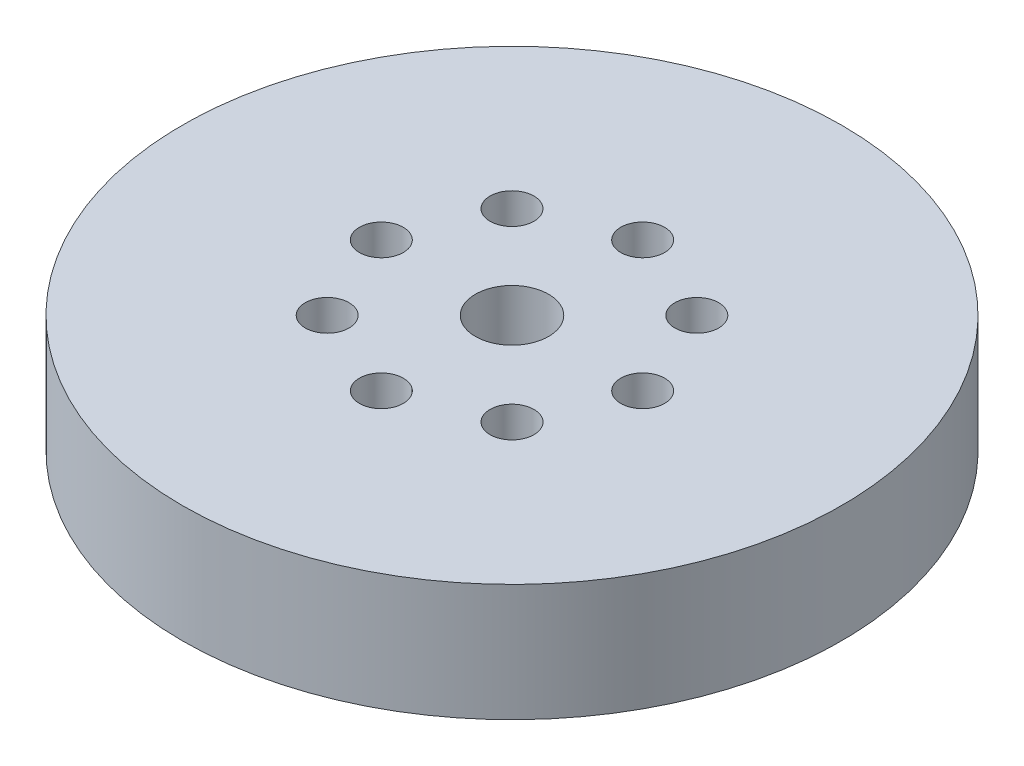
ISO-10303-21;
HEADER;
FILE_DESCRIPTION(('STEP AP214'),'2;1');
FILE_NAME('part.step','',(''),(''),'','','');
FILE_SCHEMA(('AUTOMOTIVE_DESIGN { 1 0 10303 214 1 1 1 1 }'));
ENDSEC;
DATA;
#1=APPLICATION_CONTEXT('core data for automotive mechanical design processes');
#2=APPLICATION_PROTOCOL_DEFINITION('international standard','automotive_design',2000,#1);
#3=PRODUCT_CONTEXT('',#1,'mechanical');
#4=PRODUCT('Part','Part','',(#3));
#5=PRODUCT_RELATED_PRODUCT_CATEGORY('part','',(#4));
#6=PRODUCT_DEFINITION_FORMATION('','',#4);
#7=PRODUCT_DEFINITION_CONTEXT('part definition',#1,'design');
#8=PRODUCT_DEFINITION('design','',#6,#7);
#9=PRODUCT_DEFINITION_SHAPE('','',#8);
#10=(LENGTH_UNIT() NAMED_UNIT(*) SI_UNIT(.MILLI.,.METRE.));
#11=(NAMED_UNIT(*) PLANE_ANGLE_UNIT() SI_UNIT($,.RADIAN.));
#12=(NAMED_UNIT(*) SI_UNIT($,.STERADIAN.) SOLID_ANGLE_UNIT());
#13=UNCERTAINTY_MEASURE_WITH_UNIT(LENGTH_MEASURE(1.E-05),#10,'distance_accuracy_value','');
#14=(GEOMETRIC_REPRESENTATION_CONTEXT(3) GLOBAL_UNCERTAINTY_ASSIGNED_CONTEXT((#13)) GLOBAL_UNIT_ASSIGNED_CONTEXT((#10,
#11,#12)) REPRESENTATION_CONTEXT('',''));
#15=CARTESIAN_POINT('',(0.,0.,0.));
#16=DIRECTION('',(0.,0.,1.));
#17=DIRECTION('',(1.,0.,0.));
#18=AXIS2_PLACEMENT_3D('',#15,#16,#17);
#19=CARTESIAN_POINT('',(0.,16.,0.));
#20=DIRECTION('',(0.,-1.,0.));
#21=DIRECTION('',(0.,0.,-1.));
#22=AXIS2_PLACEMENT_3D('',#19,#20,#21);
#23=CYLINDRICAL_SURFACE('',#22,45.);
#24=CARTESIAN_POINT('',(0.,16.,0.));
#25=DIRECTION('',(0.,1.,0.));
#26=DIRECTION('',(0.,0.,1.));
#27=AXIS2_PLACEMENT_3D('',#24,#25,#26);
#28=CIRCLE('',#27,45.);
#29=CARTESIAN_POINT('',(0.,16.,45.));
#30=VERTEX_POINT('',#29);
#31=EDGE_CURVE('E10',#30,#30,#28,.T.);
#32=ORIENTED_EDGE('',*,*,#31,.F.);
#33=EDGE_LOOP('',(#32));
#34=FACE_BOUND('',#33,.T.);
#35=CARTESIAN_POINT('',(0.,0.,0.));
#36=DIRECTION('',(0.,1.,0.));
#37=DIRECTION('',(0.,0.,1.));
#38=AXIS2_PLACEMENT_3D('',#35,#36,#37);
#39=CIRCLE('',#38,45.);
#40=CARTESIAN_POINT('',(0.,0.,45.));
#41=VERTEX_POINT('',#40);
#42=EDGE_CURVE('E37',#41,#41,#39,.T.);
#43=ORIENTED_EDGE('',*,*,#42,.T.);
#44=EDGE_LOOP('',(#43));
#45=FACE_BOUND('',#44,.T.);
#46=ADVANCED_FACE('F40',(#34,#45),#23,.T.);
#47=CARTESIAN_POINT('',(0.,16.,0.));
#48=DIRECTION('',(0.,1.,0.));
#49=DIRECTION('',(0.,0.,1.));
#50=AXIS2_PLACEMENT_3D('',#47,#48,#49);
#51=PLANE('',#50);
#52=CARTESIAN_POINT('',(0.,16.,17.8444050801665));
#53=DIRECTION('',(0.,1.,0.));
#54=DIRECTION('',(1.,0.,0.));
#55=AXIS2_PLACEMENT_3D('',#52,#53,#54);
#56=CIRCLE('',#55,2.99490753026362);
#57=CARTESIAN_POINT('',(2.99490753026368,16.,17.8444050801664));
#58=VERTEX_POINT('',#57);
#59=EDGE_CURVE('E88',#58,#58,#56,.T.);
#60=ORIENTED_EDGE('',*,*,#59,.F.);
#61=EDGE_LOOP('',(#60));
#62=FACE_BOUND('',#61,.T.);
#63=CARTESIAN_POINT('',(12.6178998384254,16.,12.6178998384253));
#64=DIRECTION('',(0.,1.,0.));
#65=DIRECTION('',(0.707106781186544,0.,-0.707106781186551));
#66=AXIS2_PLACEMENT_3D('',#63,#64,#65);
#67=CIRCLE('',#66,2.99490753026362);
#68=CARTESIAN_POINT('',(14.7356192621015,16.,10.5001804147492));
#69=VERTEX_POINT('',#68);
#70=EDGE_CURVE('E79',#69,#69,#67,.T.);
#71=ORIENTED_EDGE('',*,*,#70,.F.);
#72=EDGE_LOOP('',(#71));
#73=FACE_BOUND('',#72,.T.);
#74=CARTESIAN_POINT('',(17.8444050801665,16.,0.));
#75=DIRECTION('',(0.,1.,0.));
#76=DIRECTION('',(0.,0.,-1.));
#77=AXIS2_PLACEMENT_3D('',#74,#75,#76);
#78=CIRCLE('',#77,2.99490753026362);
#79=CARTESIAN_POINT('',(17.8444050801665,16.,-2.99490753026362));
#80=VERTEX_POINT('',#79);
#81=EDGE_CURVE('E74',#80,#80,#78,.T.);
#82=ORIENTED_EDGE('',*,*,#81,.F.);
#83=EDGE_LOOP('',(#82));
#84=FACE_BOUND('',#83,.T.);
#85=CARTESIAN_POINT('',(12.6178998384253,16.,-12.6178998384255));
#86=DIRECTION('',(0.,1.,0.));
#87=DIRECTION('',(-0.707106781186554,0.,-0.707106781186541));
#88=AXIS2_PLACEMENT_3D('',#85,#86,#87);
#89=CIRCLE('',#88,2.99490753026362);
#90=CARTESIAN_POINT('',(10.5001804147492,16.,-14.7356192621015));
#91=VERTEX_POINT('',#90);
#92=EDGE_CURVE('E70',#91,#91,#89,.T.);
#93=ORIENTED_EDGE('',*,*,#92,.F.);
#94=EDGE_LOOP('',(#93));
#95=FACE_BOUND('',#94,.T.);
#96=CARTESIAN_POINT('',(-1.86910222020476E-13,16.,-17.8444050801665));
#97=DIRECTION('',(0.,1.,0.));
#98=DIRECTION('',(-1.,0.,0.));
#99=AXIS2_PLACEMENT_3D('',#96,#97,#98);
#100=CIRCLE('',#99,2.99490753026362);
#101=CARTESIAN_POINT('',(-2.99490753026381,16.,-17.8444050801664));
#102=VERTEX_POINT('',#101);
#103=EDGE_CURVE('E100',#102,#102,#100,.T.);
#104=ORIENTED_EDGE('',*,*,#103,.F.);
#105=EDGE_LOOP('',(#104));
#106=FACE_BOUND('',#105,.T.);
#107=CARTESIAN_POINT('',(-12.6178998384255,16.,-12.6178998384252));
#108=DIRECTION('',(0.,1.,0.));
#109=DIRECTION('',(-0.707106781186539,0.,0.707106781186556));
#110=AXIS2_PLACEMENT_3D('',#107,#108,#109);
#111=CIRCLE('',#110,2.99490753026362);
#112=CARTESIAN_POINT('',(-14.7356192621016,16.,-10.5001804147491));
#113=VERTEX_POINT('',#112);
#114=EDGE_CURVE('E93',#113,#113,#111,.T.);
#115=ORIENTED_EDGE('',*,*,#114,.F.);
#116=EDGE_LOOP('',(#115));
#117=FACE_BOUND('',#116,.T.);
#118=CARTESIAN_POINT('',(-12.6178998384254,16.,12.6178998384254));
#119=DIRECTION('',(0.,1.,0.));
#120=DIRECTION('',(0.707106781186549,0.,0.707106781186546));
#121=AXIS2_PLACEMENT_3D('',#118,#119,#120);
#122=CIRCLE('',#121,2.99490753026362);
#123=CARTESIAN_POINT('',(-10.5001804147493,16.,14.7356192621015));
#124=VERTEX_POINT('',#123);
#125=EDGE_CURVE('E61',#124,#124,#122,.T.);
#126=ORIENTED_EDGE('',*,*,#125,.F.);
#127=EDGE_LOOP('',(#126));
#128=FACE_BOUND('',#127,.T.);
#129=CARTESIAN_POINT('',(-17.8444050801665,16.,0.));
#130=DIRECTION('',(0.,1.,0.));
#131=DIRECTION('',(0.,0.,1.));
#132=AXIS2_PLACEMENT_3D('',#129,#130,#131);
#133=CIRCLE('',#132,2.99490753026362);
#134=CARTESIAN_POINT('',(-17.8444050801665,16.,2.99490753026362));
#135=VERTEX_POINT('',#134);
#136=EDGE_CURVE('E54',#135,#135,#133,.T.);
#137=ORIENTED_EDGE('',*,*,#136,.F.);
#138=EDGE_LOOP('',(#137));
#139=FACE_BOUND('',#138,.T.);
#140=CARTESIAN_POINT('',(0.,16.,0.));
#141=DIRECTION('',(0.,1.,0.));
#142=DIRECTION('',(0.,0.,1.));
#143=AXIS2_PLACEMENT_3D('',#140,#141,#142);
#144=CIRCLE('',#143,5.);
#145=CARTESIAN_POINT('',(0.,16.,5.));
#146=VERTEX_POINT('',#145);
#147=EDGE_CURVE('E50',#146,#146,#144,.T.);
#148=ORIENTED_EDGE('',*,*,#147,.F.);
#149=EDGE_LOOP('',(#148));
#150=FACE_BOUND('',#149,.T.);
#151=ORIENTED_EDGE('',*,*,#31,.T.);
#152=EDGE_LOOP('',(#151));
#153=FACE_BOUND('',#152,.T.);
#154=ADVANCED_FACE('F115',(#62,#73,#84,#95,#106,#117,#128,#139,#150,#153),#51,.T.);
#155=CARTESIAN_POINT('',(0.,0.,0.));
#156=DIRECTION('',(0.,1.,0.));
#157=DIRECTION('',(0.,0.,1.));
#158=AXIS2_PLACEMENT_3D('',#155,#156,#157);
#159=PLANE('',#158);
#160=CARTESIAN_POINT('',(0.,0.,0.));
#161=DIRECTION('',(0.,1.,0.));
#162=DIRECTION('',(0.,0.,1.));
#163=AXIS2_PLACEMENT_3D('',#160,#161,#162);
#164=CIRCLE('',#163,5.);
#165=CARTESIAN_POINT('',(0.,0.,5.));
#166=VERTEX_POINT('',#165);
#167=EDGE_CURVE('E47',#166,#166,#164,.T.);
#168=ORIENTED_EDGE('',*,*,#167,.T.);
#169=EDGE_LOOP('',(#168));
#170=FACE_BOUND('',#169,.T.);
#171=ORIENTED_EDGE('',*,*,#42,.F.);
#172=EDGE_LOOP('',(#171));
#173=FACE_BOUND('',#172,.T.);
#174=ADVANCED_FACE('F113',(#170,#173),#159,.F.);
#175=CARTESIAN_POINT('',(0.,16.,0.));
#176=DIRECTION('',(0.,-1.,0.));
#177=DIRECTION('',(0.,0.,-1.));
#178=AXIS2_PLACEMENT_3D('',#175,#176,#177);
#179=CYLINDRICAL_SURFACE('',#178,5.);
#180=ORIENTED_EDGE('',*,*,#147,.T.);
#181=EDGE_LOOP('',(#180));
#182=FACE_BOUND('',#181,.T.);
#183=ORIENTED_EDGE('',*,*,#167,.F.);
#184=EDGE_LOOP('',(#183));
#185=FACE_BOUND('',#184,.T.);
#186=ADVANCED_FACE('F127',(#182,#185),#179,.F.);
#187=CARTESIAN_POINT('',(-17.8444050801665,5.88848733933087,0.));
#188=DIRECTION('',(0.,1.,0.));
#189=DIRECTION('',(0.,0.,1.));
#190=AXIS2_PLACEMENT_3D('',#187,#188,#189);
#191=CYLINDRICAL_SURFACE('',#190,2.99490753026362);
#192=CARTESIAN_POINT('',(-17.8444050801665,5.88848733933087,0.));
#193=DIRECTION('',(0.,1.,0.));
#194=DIRECTION('',(0.,0.,1.));
#195=AXIS2_PLACEMENT_3D('',#192,#193,#194);
#196=CIRCLE('',#195,2.99490753026362);
#197=CARTESIAN_POINT('',(-17.8444050801665,5.88848733933087,2.99490753026362));
#198=VERTEX_POINT('',#197);
#199=EDGE_CURVE('E55',#198,#198,#196,.T.);
#200=ORIENTED_EDGE('',*,*,#199,.F.);
#201=EDGE_LOOP('',(#200));
#202=FACE_BOUND('',#201,.T.);
#203=ORIENTED_EDGE('',*,*,#136,.T.);
#204=EDGE_LOOP('',(#203));
#205=FACE_BOUND('',#204,.T.);
#206=ADVANCED_FACE('F129',(#202,#205),#191,.F.);
#207=CARTESIAN_POINT('',(-17.8444050801665,5.88848733933087,0.));
#208=DIRECTION('',(0.,1.,0.));
#209=DIRECTION('',(0.,0.,1.));
#210=AXIS2_PLACEMENT_3D('',#207,#208,#209);
#211=PLANE('',#210);
#212=ORIENTED_EDGE('',*,*,#199,.T.);
#213=EDGE_LOOP('',(#212));
#214=FACE_BOUND('',#213,.T.);
#215=ADVANCED_FACE('F157',(#214),#211,.T.);
#216=CARTESIAN_POINT('',(-12.6178998384254,5.88848733933087,12.6178998384254));
#217=DIRECTION('',(0.,1.,0.));
#218=DIRECTION('',(0.,0.,1.));
#219=AXIS2_PLACEMENT_3D('',#216,#217,#218);
#220=CYLINDRICAL_SURFACE('',#219,2.99490753026362);
#221=CARTESIAN_POINT('',(-12.6178998384254,5.88848733933087,12.6178998384254));
#222=DIRECTION('',(0.,1.,0.));
#223=DIRECTION('',(0.707106781186549,0.,0.707106781186546));
#224=AXIS2_PLACEMENT_3D('',#221,#222,#223);
#225=CIRCLE('',#224,2.99490753026362);
#226=CARTESIAN_POINT('',(-10.5001804147493,5.88848733933087,14.7356192621015));
#227=VERTEX_POINT('',#226);
#228=EDGE_CURVE('E59',#227,#227,#225,.T.);
#229=ORIENTED_EDGE('',*,*,#228,.F.);
#230=EDGE_LOOP('',(#229));
#231=FACE_BOUND('',#230,.T.);
#232=ORIENTED_EDGE('',*,*,#125,.T.);
#233=EDGE_LOOP('',(#232));
#234=FACE_BOUND('',#233,.T.);
#235=ADVANCED_FACE('F170',(#231,#234),#220,.F.);
#236=CARTESIAN_POINT('',(-12.6178998384254,5.88848733933087,12.6178998384254));
#237=DIRECTION('',(0.,1.,0.));
#238=DIRECTION('',(0.707106781186549,0.,0.707106781186546));
#239=AXIS2_PLACEMENT_3D('',#236,#237,#238);
#240=PLANE('',#239);
#241=ORIENTED_EDGE('',*,*,#228,.T.);
#242=EDGE_LOOP('',(#241));
#243=FACE_BOUND('',#242,.T.);
#244=ADVANCED_FACE('F182',(#243),#240,.T.);
#245=CARTESIAN_POINT('',(-12.6178998384255,5.88848733933087,-12.6178998384252));
#246=DIRECTION('',(0.,1.,0.));
#247=DIRECTION('',(0.,0.,1.));
#248=AXIS2_PLACEMENT_3D('',#245,#246,#247);
#249=CYLINDRICAL_SURFACE('',#248,2.99490753026362);
#250=CARTESIAN_POINT('',(-12.6178998384255,5.88848733933087,-12.6178998384252));
#251=DIRECTION('',(0.,1.,0.));
#252=DIRECTION('',(-0.707106781186539,0.,0.707106781186556));
#253=AXIS2_PLACEMENT_3D('',#250,#251,#252);
#254=CIRCLE('',#253,2.99490753026362);
#255=CARTESIAN_POINT('',(-14.7356192621016,5.88848733933087,-10.5001804147491));
#256=VERTEX_POINT('',#255);
#257=EDGE_CURVE('E94',#256,#256,#254,.T.);
#258=ORIENTED_EDGE('',*,*,#257,.F.);
#259=EDGE_LOOP('',(#258));
#260=FACE_BOUND('',#259,.T.);
#261=ORIENTED_EDGE('',*,*,#114,.T.);
#262=EDGE_LOOP('',(#261));
#263=FACE_BOUND('',#262,.T.);
#264=ADVANCED_FACE('F189',(#260,#263),#249,.F.);
#265=CARTESIAN_POINT('',(-12.6178998384255,5.88848733933087,-12.6178998384252));
#266=DIRECTION('',(0.,1.,0.));
#267=DIRECTION('',(-0.707106781186539,0.,0.707106781186556));
#268=AXIS2_PLACEMENT_3D('',#265,#266,#267);
#269=PLANE('',#268);
#270=ORIENTED_EDGE('',*,*,#257,.T.);
#271=EDGE_LOOP('',(#270));
#272=FACE_BOUND('',#271,.T.);
#273=ADVANCED_FACE('F107',(#272),#269,.T.);
#274=CARTESIAN_POINT('',(-1.86910222020476E-13,5.88848733933087,-17.8444050801665));
#275=DIRECTION('',(0.,1.,0.));
#276=DIRECTION('',(0.,0.,1.));
#277=AXIS2_PLACEMENT_3D('',#274,#275,#276);
#278=CYLINDRICAL_SURFACE('',#277,2.99490753026362);
#279=CARTESIAN_POINT('',(-1.86910222020476E-13,5.88848733933087,-17.8444050801665));
#280=DIRECTION('',(0.,1.,0.));
#281=DIRECTION('',(-1.,0.,0.));
#282=AXIS2_PLACEMENT_3D('',#279,#280,#281);
#283=CIRCLE('',#282,2.99490753026362);
#284=CARTESIAN_POINT('',(-2.99490753026381,5.88848733933087,-17.8444050801664));
#285=VERTEX_POINT('',#284);
#286=EDGE_CURVE('E72',#285,#285,#283,.T.);
#287=ORIENTED_EDGE('',*,*,#286,.F.);
#288=EDGE_LOOP('',(#287));
#289=FACE_BOUND('',#288,.T.);
#290=ORIENTED_EDGE('',*,*,#103,.T.);
#291=EDGE_LOOP('',(#290));
#292=FACE_BOUND('',#291,.T.);
#293=ADVANCED_FACE('F104',(#289,#292),#278,.F.);
#294=CARTESIAN_POINT('',(-1.86910222020476E-13,5.88848733933087,-17.8444050801665));
#295=DIRECTION('',(0.,1.,0.));
#296=DIRECTION('',(-1.,0.,0.));
#297=AXIS2_PLACEMENT_3D('',#294,#295,#296);
#298=PLANE('',#297);
#299=ORIENTED_EDGE('',*,*,#286,.T.);
#300=EDGE_LOOP('',(#299));
#301=FACE_BOUND('',#300,.T.);
#302=ADVANCED_FACE('F103',(#301),#298,.T.);
#303=CARTESIAN_POINT('',(12.6178998384253,5.88848733933087,-12.6178998384255));
#304=DIRECTION('',(0.,1.,0.));
#305=DIRECTION('',(0.,0.,1.));
#306=AXIS2_PLACEMENT_3D('',#303,#304,#305);
#307=CYLINDRICAL_SURFACE('',#306,2.99490753026362);
#308=CARTESIAN_POINT('',(12.6178998384253,5.88848733933087,-12.6178998384255));
#309=DIRECTION('',(0.,1.,0.));
#310=DIRECTION('',(-0.707106781186554,0.,-0.707106781186541));
#311=AXIS2_PLACEMENT_3D('',#308,#309,#310);
#312=CIRCLE('',#311,2.99490753026362);
#313=CARTESIAN_POINT('',(10.5001804147492,5.88848733933087,-14.7356192621015));
#314=VERTEX_POINT('',#313);
#315=EDGE_CURVE('E69',#314,#314,#312,.T.);
#316=ORIENTED_EDGE('',*,*,#315,.F.);
#317=EDGE_LOOP('',(#316));
#318=FACE_BOUND('',#317,.T.);
#319=ORIENTED_EDGE('',*,*,#92,.T.);
#320=EDGE_LOOP('',(#319));
#321=FACE_BOUND('',#320,.T.);
#322=ADVANCED_FACE('F219',(#318,#321),#307,.F.);
#323=CARTESIAN_POINT('',(12.6178998384253,5.88848733933087,-12.6178998384255));
#324=DIRECTION('',(0.,1.,0.));
#325=DIRECTION('',(-0.707106781186554,0.,-0.707106781186541));
#326=AXIS2_PLACEMENT_3D('',#323,#324,#325);
#327=PLANE('',#326);
#328=ORIENTED_EDGE('',*,*,#315,.T.);
#329=EDGE_LOOP('',(#328));
#330=FACE_BOUND('',#329,.T.);
#331=ADVANCED_FACE('F227',(#330),#327,.T.);
#332=CARTESIAN_POINT('',(17.8444050801665,5.88848733933087,0.));
#333=DIRECTION('',(0.,1.,0.));
#334=DIRECTION('',(0.,0.,1.));
#335=AXIS2_PLACEMENT_3D('',#332,#333,#334);
#336=CYLINDRICAL_SURFACE('',#335,2.99490753026362);
#337=CARTESIAN_POINT('',(17.8444050801665,5.88848733933087,0.));
#338=DIRECTION('',(0.,1.,0.));
#339=DIRECTION('',(0.,0.,-1.));
#340=AXIS2_PLACEMENT_3D('',#337,#338,#339);
#341=CIRCLE('',#340,2.99490753026362);
#342=CARTESIAN_POINT('',(17.8444050801665,5.88848733933087,-2.99490753026362));
#343=VERTEX_POINT('',#342);
#344=EDGE_CURVE('E80',#343,#343,#341,.T.);
#345=ORIENTED_EDGE('',*,*,#344,.F.);
#346=EDGE_LOOP('',(#345));
#347=FACE_BOUND('',#346,.T.);
#348=ORIENTED_EDGE('',*,*,#81,.T.);
#349=EDGE_LOOP('',(#348));
#350=FACE_BOUND('',#349,.T.);
#351=ADVANCED_FACE('F240',(#347,#350),#336,.F.);
#352=CARTESIAN_POINT('',(17.8444050801665,5.88848733933087,0.));
#353=DIRECTION('',(0.,1.,0.));
#354=DIRECTION('',(0.,0.,-1.));
#355=AXIS2_PLACEMENT_3D('',#352,#353,#354);
#356=PLANE('',#355);
#357=ORIENTED_EDGE('',*,*,#344,.T.);
#358=EDGE_LOOP('',(#357));
#359=FACE_BOUND('',#358,.T.);
#360=ADVANCED_FACE('F246',(#359),#356,.T.);
#361=CARTESIAN_POINT('',(12.6178998384254,5.88848733933087,12.6178998384253));
#362=DIRECTION('',(0.,1.,0.));
#363=DIRECTION('',(0.,0.,1.));
#364=AXIS2_PLACEMENT_3D('',#361,#362,#363);
#365=CYLINDRICAL_SURFACE('',#364,2.99490753026362);
#366=CARTESIAN_POINT('',(12.6178998384254,5.88848733933087,12.6178998384253));
#367=DIRECTION('',(0.,1.,0.));
#368=DIRECTION('',(0.707106781186544,0.,-0.707106781186551));
#369=AXIS2_PLACEMENT_3D('',#366,#367,#368);
#370=CIRCLE('',#369,2.99490753026362);
#371=CARTESIAN_POINT('',(14.7356192621015,5.88848733933087,10.5001804147492));
#372=VERTEX_POINT('',#371);
#373=EDGE_CURVE('E82',#372,#372,#370,.T.);
#374=ORIENTED_EDGE('',*,*,#373,.F.);
#375=EDGE_LOOP('',(#374));
#376=FACE_BOUND('',#375,.T.);
#377=ORIENTED_EDGE('',*,*,#70,.T.);
#378=EDGE_LOOP('',(#377));
#379=FACE_BOUND('',#378,.T.);
#380=ADVANCED_FACE('F254',(#376,#379),#365,.F.);
#381=CARTESIAN_POINT('',(12.6178998384254,5.88848733933087,12.6178998384253));
#382=DIRECTION('',(0.,1.,0.));
#383=DIRECTION('',(0.707106781186544,0.,-0.707106781186551));
#384=AXIS2_PLACEMENT_3D('',#381,#382,#383);
#385=PLANE('',#384);
#386=ORIENTED_EDGE('',*,*,#373,.T.);
#387=EDGE_LOOP('',(#386));
#388=FACE_BOUND('',#387,.T.);
#389=ADVANCED_FACE('F262',(#388),#385,.T.);
#390=CARTESIAN_POINT('',(0.,5.88848733933087,17.8444050801665));
#391=DIRECTION('',(0.,1.,0.));
#392=DIRECTION('',(0.,0.,1.));
#393=AXIS2_PLACEMENT_3D('',#390,#391,#392);
#394=CYLINDRICAL_SURFACE('',#393,2.99490753026362);
#395=CARTESIAN_POINT('',(0.,5.88848733933087,17.8444050801665));
#396=DIRECTION('',(0.,1.,0.));
#397=DIRECTION('',(1.,0.,0.));
#398=AXIS2_PLACEMENT_3D('',#395,#396,#397);
#399=CIRCLE('',#398,2.99490753026362);
#400=CARTESIAN_POINT('',(2.99490753026368,5.88848733933087,17.8444050801664));
#401=VERTEX_POINT('',#400);
#402=EDGE_CURVE('E63',#401,#401,#399,.T.);
#403=ORIENTED_EDGE('',*,*,#402,.F.);
#404=EDGE_LOOP('',(#403));
#405=FACE_BOUND('',#404,.T.);
#406=ORIENTED_EDGE('',*,*,#59,.T.);
#407=EDGE_LOOP('',(#406));
#408=FACE_BOUND('',#407,.T.);
#409=ADVANCED_FACE('F272',(#405,#408),#394,.F.);
#410=CARTESIAN_POINT('',(0.,5.88848733933087,17.8444050801665));
#411=DIRECTION('',(0.,1.,0.));
#412=DIRECTION('',(1.,0.,0.));
#413=AXIS2_PLACEMENT_3D('',#410,#411,#412);
#414=PLANE('',#413);
#415=ORIENTED_EDGE('',*,*,#402,.T.);
#416=EDGE_LOOP('',(#415));
#417=FACE_BOUND('',#416,.T.);
#418=ADVANCED_FACE('F285',(#417),#414,.T.);
#419=CLOSED_SHELL('',(#46,#154,#174,#186,#206,#215,#235,#244,#264,#273,#293,#302,#322,#331,#351,
#360,#380,#389,#409,#418));
#420=MANIFOLD_SOLID_BREP('B2',#419);
#421=ADVANCED_BREP_SHAPE_REPRESENTATION('',(#18,#420),#14);
#422=SHAPE_DEFINITION_REPRESENTATION(#9,#421);
ENDSEC;
END-ISO-10303-21;
